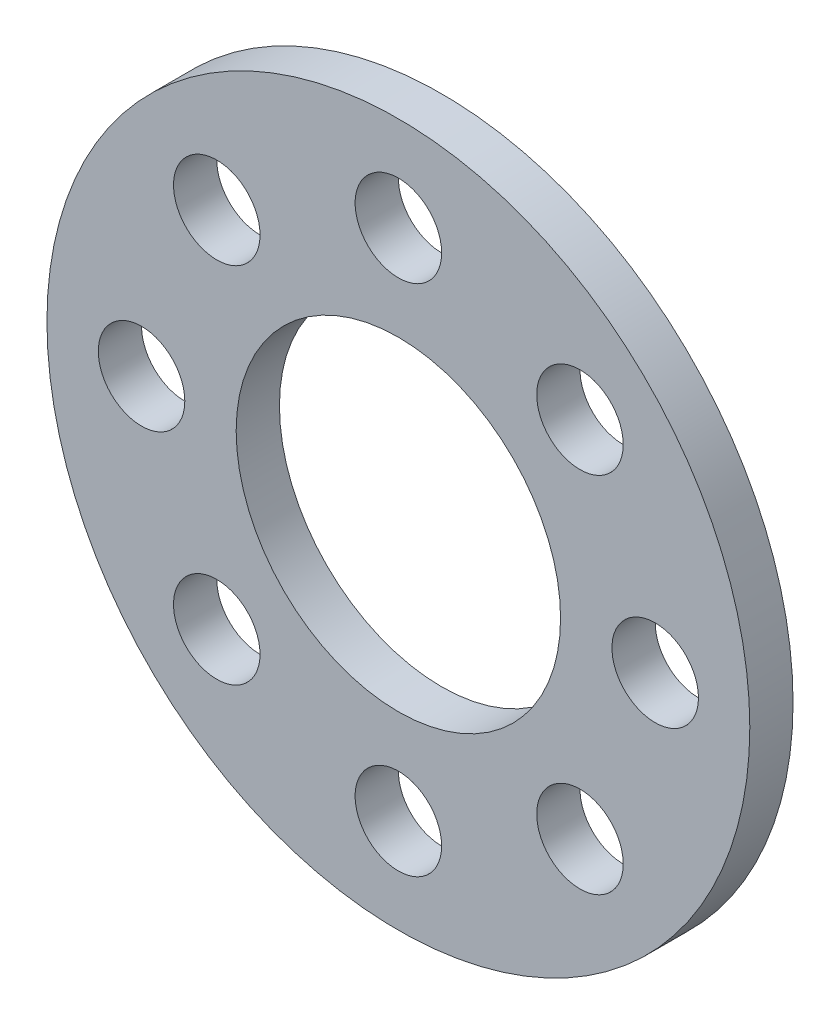
ISO-10303-21;
HEADER;
FILE_DESCRIPTION(('STEP AP214'),'2;1');
FILE_NAME('part.step','',(''),(''),'','','');
FILE_SCHEMA(('AUTOMOTIVE_DESIGN { 1 0 10303 214 1 1 1 1 }'));
ENDSEC;
DATA;
#1=APPLICATION_CONTEXT('core data for automotive mechanical design processes');
#2=APPLICATION_PROTOCOL_DEFINITION('international standard','automotive_design',2000,#1);
#3=PRODUCT_CONTEXT('',#1,'mechanical');
#4=PRODUCT('Part','Part','',(#3));
#5=PRODUCT_RELATED_PRODUCT_CATEGORY('part','',(#4));
#6=PRODUCT_DEFINITION_FORMATION('','',#4);
#7=PRODUCT_DEFINITION_CONTEXT('part definition',#1,'design');
#8=PRODUCT_DEFINITION('design','',#6,#7);
#9=PRODUCT_DEFINITION_SHAPE('','',#8);
#10=(LENGTH_UNIT() NAMED_UNIT(*) SI_UNIT(.MILLI.,.METRE.));
#11=(NAMED_UNIT(*) PLANE_ANGLE_UNIT() SI_UNIT($,.RADIAN.));
#12=(NAMED_UNIT(*) SI_UNIT($,.STERADIAN.) SOLID_ANGLE_UNIT());
#13=UNCERTAINTY_MEASURE_WITH_UNIT(LENGTH_MEASURE(1.E-05),#10,'distance_accuracy_value','');
#14=(GEOMETRIC_REPRESENTATION_CONTEXT(3) GLOBAL_UNCERTAINTY_ASSIGNED_CONTEXT((#13)) GLOBAL_UNIT_ASSIGNED_CONTEXT((#10,
#11,#12)) REPRESENTATION_CONTEXT('',''));
#15=CARTESIAN_POINT('',(0.,0.,0.));
#16=DIRECTION('',(0.,0.,1.));
#17=DIRECTION('',(1.,0.,0.));
#18=AXIS2_PLACEMENT_3D('',#15,#16,#17);
#19=CARTESIAN_POINT('',(0.,0.,2.));
#20=DIRECTION('',(0.,0.,1.));
#21=DIRECTION('',(1.,0.,0.));
#22=AXIS2_PLACEMENT_3D('',#19,#20,#21);
#23=PLANE('',#22);
#24=CARTESIAN_POINT('',(-11.874999999999,-1.01252339845814E-12,2.));
#25=DIRECTION('',(0.,0.,1.));
#26=DIRECTION('',(1.,0.,0.));
#27=AXIS2_PLACEMENT_3D('',#24,#25,#26);
#28=CIRCLE('',#27,2.00000000000138);
#29=CARTESIAN_POINT('',(-9.87499999999761,-1.01252339845814E-12,2.));
#30=VERTEX_POINT('',#29);
#31=EDGE_CURVE('E83',#30,#30,#28,.T.);
#32=ORIENTED_EDGE('',*,*,#31,.F.);
#33=EDGE_LOOP('',(#32));
#34=FACE_BOUND('',#33,.T.);
#35=CARTESIAN_POINT('',(2.02213826076831E-12,-11.875,2.));
#36=DIRECTION('',(0.,0.,1.));
#37=DIRECTION('',(1.,0.,0.));
#38=AXIS2_PLACEMENT_3D('',#35,#36,#37);
#39=CIRCLE('',#38,2.00000000000201);
#40=CARTESIAN_POINT('',(2.00000000000403,-11.875,2.));
#41=VERTEX_POINT('',#40);
#42=EDGE_CURVE('E71',#41,#41,#39,.T.);
#43=ORIENTED_EDGE('',*,*,#42,.F.);
#44=EDGE_LOOP('',(#43));
#45=FACE_BOUND('',#44,.T.);
#46=CARTESIAN_POINT('',(11.875000000001,1.01106913038416E-12,2.));
#47=DIRECTION('',(0.,0.,1.));
#48=DIRECTION('',(1.,0.,0.));
#49=AXIS2_PLACEMENT_3D('',#46,#47,#48);
#50=CIRCLE('',#49,2.00000000000071);
#51=CARTESIAN_POINT('',(13.8750000000017,1.01106913038416E-12,2.));
#52=VERTEX_POINT('',#51);
#53=EDGE_CURVE('E59',#52,#52,#50,.T.);
#54=ORIENTED_EDGE('',*,*,#53,.F.);
#55=EDGE_LOOP('',(#54));
#56=FACE_BOUND('',#55,.T.);
#57=CARTESIAN_POINT('',(0.,11.875,2.));
#58=DIRECTION('',(0.,0.,1.));
#59=DIRECTION('',(1.,0.,0.));
#60=AXIS2_PLACEMENT_3D('',#57,#58,#59);
#61=CIRCLE('',#60,2.);
#62=CARTESIAN_POINT('',(2.,11.875,2.));
#63=VERTEX_POINT('',#62);
#64=EDGE_CURVE('E47',#63,#63,#61,.T.);
#65=ORIENTED_EDGE('',*,*,#64,.F.);
#66=EDGE_LOOP('',(#65));
#67=FACE_BOUND('',#66,.T.);
#68=CARTESIAN_POINT('',(0.,0.,2.));
#69=DIRECTION('',(0.,0.,1.));
#70=DIRECTION('',(1.,0.,0.));
#71=AXIS2_PLACEMENT_3D('',#68,#69,#70);
#72=CIRCLE('',#71,16.25);
#73=CARTESIAN_POINT('',(16.25,0.,2.));
#74=VERTEX_POINT('',#73);
#75=EDGE_CURVE('E10',#74,#74,#72,.T.);
#76=ORIENTED_EDGE('',*,*,#75,.T.);
#77=EDGE_LOOP('',(#76));
#78=FACE_BOUND('',#77,.T.);
#79=CARTESIAN_POINT('',(0.,0.,2.));
#80=DIRECTION('',(0.,0.,1.));
#81=DIRECTION('',(1.,0.,0.));
#82=AXIS2_PLACEMENT_3D('',#79,#80,#81);
#83=CIRCLE('',#82,7.5);
#84=CARTESIAN_POINT('',(7.5,0.,2.));
#85=VERTEX_POINT('',#84);
#86=EDGE_CURVE('E42',#85,#85,#83,.T.);
#87=ORIENTED_EDGE('',*,*,#86,.F.);
#88=EDGE_LOOP('',(#87));
#89=FACE_BOUND('',#88,.T.);
#90=CARTESIAN_POINT('',(8.39689302659055,8.39689302659096,2.));
#91=DIRECTION('',(0.,0.,1.));
#92=DIRECTION('',(1.,0.,0.));
#93=AXIS2_PLACEMENT_3D('',#90,#91,#92);
#94=CIRCLE('',#93,2.00000000000009);
#95=CARTESIAN_POINT('',(10.3968930265906,8.39689302659096,2.));
#96=VERTEX_POINT('',#95);
#97=EDGE_CURVE('E53',#96,#96,#94,.T.);
#98=ORIENTED_EDGE('',*,*,#97,.F.);
#99=EDGE_LOOP('',(#98));
#100=FACE_BOUND('',#99,.T.);
#101=CARTESIAN_POINT('',(8.39689302659198,-8.39689302658954,2.));
#102=DIRECTION('',(0.,0.,1.));
#103=DIRECTION('',(1.,0.,0.));
#104=AXIS2_PLACEMENT_3D('',#101,#102,#103);
#105=CIRCLE('',#104,2.0000000000015);
#106=CARTESIAN_POINT('',(10.3968930265935,-8.39689302658954,2.));
#107=VERTEX_POINT('',#106);
#108=EDGE_CURVE('E65',#107,#107,#105,.T.);
#109=ORIENTED_EDGE('',*,*,#108,.F.);
#110=EDGE_LOOP('',(#109));
#111=FACE_BOUND('',#110,.T.);
#112=CARTESIAN_POINT('',(-8.39689302658853,-8.39689302659097,2.));
#113=DIRECTION('',(0.,0.,1.));
#114=DIRECTION('',(1.,0.,0.));
#115=AXIS2_PLACEMENT_3D('',#112,#113,#114);
#116=CIRCLE('',#115,2.00000000000196);
#117=CARTESIAN_POINT('',(-6.39689302658657,-8.39689302659097,2.));
#118=VERTEX_POINT('',#117);
#119=EDGE_CURVE('E77',#118,#118,#116,.T.);
#120=ORIENTED_EDGE('',*,*,#119,.F.);
#121=EDGE_LOOP('',(#120));
#122=FACE_BOUND('',#121,.T.);
#123=CARTESIAN_POINT('',(-8.39689302658996,8.39689302658953,2.));
#124=DIRECTION('',(0.,0.,1.));
#125=DIRECTION('',(1.,0.,0.));
#126=AXIS2_PLACEMENT_3D('',#123,#124,#125);
#127=CIRCLE('',#126,2.00000000000064);
#128=CARTESIAN_POINT('',(-6.39689302658932,8.39689302658953,2.));
#129=VERTEX_POINT('',#128);
#130=EDGE_CURVE('E89',#129,#129,#127,.T.);
#131=ORIENTED_EDGE('',*,*,#130,.F.);
#132=EDGE_LOOP('',(#131));
#133=FACE_BOUND('',#132,.T.);
#134=ADVANCED_FACE('F31',(#34,#45,#56,#67,#78,#89,#100,#111,#122,#133),#23,.T.);
#135=CARTESIAN_POINT('',(0.,0.,0.));
#136=DIRECTION('',(0.,0.,1.));
#137=DIRECTION('',(1.,0.,0.));
#138=AXIS2_PLACEMENT_3D('',#135,#136,#137);
#139=PLANE('',#138);
#140=CARTESIAN_POINT('',(0.,0.,0.));
#141=DIRECTION('',(0.,0.,1.));
#142=DIRECTION('',(1.,0.,0.));
#143=AXIS2_PLACEMENT_3D('',#140,#141,#142);
#144=CIRCLE('',#143,16.25);
#145=CARTESIAN_POINT('',(16.25,0.,0.));
#146=VERTEX_POINT('',#145);
#147=EDGE_CURVE('E35',#146,#146,#144,.T.);
#148=ORIENTED_EDGE('',*,*,#147,.F.);
#149=EDGE_LOOP('',(#148));
#150=FACE_BOUND('',#149,.T.);
#151=CARTESIAN_POINT('',(0.,0.,0.));
#152=DIRECTION('',(0.,0.,1.));
#153=DIRECTION('',(1.,0.,0.));
#154=AXIS2_PLACEMENT_3D('',#151,#152,#153);
#155=CIRCLE('',#154,7.5);
#156=CARTESIAN_POINT('',(7.5,0.,0.));
#157=VERTEX_POINT('',#156);
#158=EDGE_CURVE('E44',#157,#157,#155,.T.);
#159=ORIENTED_EDGE('',*,*,#158,.T.);
#160=EDGE_LOOP('',(#159));
#161=FACE_BOUND('',#160,.T.);
#162=CARTESIAN_POINT('',(0.,11.875,0.));
#163=DIRECTION('',(0.,0.,1.));
#164=DIRECTION('',(1.,0.,0.));
#165=AXIS2_PLACEMENT_3D('',#162,#163,#164);
#166=CIRCLE('',#165,2.);
#167=CARTESIAN_POINT('',(2.,11.875,0.));
#168=VERTEX_POINT('',#167);
#169=EDGE_CURVE('E50',#168,#168,#166,.T.);
#170=ORIENTED_EDGE('',*,*,#169,.T.);
#171=EDGE_LOOP('',(#170));
#172=FACE_BOUND('',#171,.T.);
#173=CARTESIAN_POINT('',(8.39689302659055,8.39689302659096,0.));
#174=DIRECTION('',(0.,0.,1.));
#175=DIRECTION('',(1.,0.,0.));
#176=AXIS2_PLACEMENT_3D('',#173,#174,#175);
#177=CIRCLE('',#176,2.00000000000009);
#178=CARTESIAN_POINT('',(10.3968930265906,8.39689302659096,0.));
#179=VERTEX_POINT('',#178);
#180=EDGE_CURVE('E56',#179,#179,#177,.T.);
#181=ORIENTED_EDGE('',*,*,#180,.T.);
#182=EDGE_LOOP('',(#181));
#183=FACE_BOUND('',#182,.T.);
#184=CARTESIAN_POINT('',(11.875000000001,1.01106913038416E-12,0.));
#185=DIRECTION('',(0.,0.,1.));
#186=DIRECTION('',(1.,0.,0.));
#187=AXIS2_PLACEMENT_3D('',#184,#185,#186);
#188=CIRCLE('',#187,2.00000000000071);
#189=CARTESIAN_POINT('',(13.8750000000017,1.01106913038416E-12,0.));
#190=VERTEX_POINT('',#189);
#191=EDGE_CURVE('E62',#190,#190,#188,.T.);
#192=ORIENTED_EDGE('',*,*,#191,.T.);
#193=EDGE_LOOP('',(#192));
#194=FACE_BOUND('',#193,.T.);
#195=CARTESIAN_POINT('',(8.39689302659198,-8.39689302658954,0.));
#196=DIRECTION('',(0.,0.,1.));
#197=DIRECTION('',(1.,0.,0.));
#198=AXIS2_PLACEMENT_3D('',#195,#196,#197);
#199=CIRCLE('',#198,2.0000000000015);
#200=CARTESIAN_POINT('',(10.3968930265935,-8.39689302658954,0.));
#201=VERTEX_POINT('',#200);
#202=EDGE_CURVE('E68',#201,#201,#199,.T.);
#203=ORIENTED_EDGE('',*,*,#202,.T.);
#204=EDGE_LOOP('',(#203));
#205=FACE_BOUND('',#204,.T.);
#206=CARTESIAN_POINT('',(2.02213826076831E-12,-11.875,0.));
#207=DIRECTION('',(0.,0.,1.));
#208=DIRECTION('',(1.,0.,0.));
#209=AXIS2_PLACEMENT_3D('',#206,#207,#208);
#210=CIRCLE('',#209,2.00000000000201);
#211=CARTESIAN_POINT('',(2.00000000000403,-11.875,0.));
#212=VERTEX_POINT('',#211);
#213=EDGE_CURVE('E74',#212,#212,#210,.T.);
#214=ORIENTED_EDGE('',*,*,#213,.T.);
#215=EDGE_LOOP('',(#214));
#216=FACE_BOUND('',#215,.T.);
#217=CARTESIAN_POINT('',(-8.39689302658853,-8.39689302659097,0.));
#218=DIRECTION('',(0.,0.,1.));
#219=DIRECTION('',(1.,0.,0.));
#220=AXIS2_PLACEMENT_3D('',#217,#218,#219);
#221=CIRCLE('',#220,2.00000000000196);
#222=CARTESIAN_POINT('',(-6.39689302658657,-8.39689302659097,0.));
#223=VERTEX_POINT('',#222);
#224=EDGE_CURVE('E80',#223,#223,#221,.T.);
#225=ORIENTED_EDGE('',*,*,#224,.T.);
#226=EDGE_LOOP('',(#225));
#227=FACE_BOUND('',#226,.T.);
#228=CARTESIAN_POINT('',(-11.874999999999,-1.01252339845814E-12,0.));
#229=DIRECTION('',(0.,0.,1.));
#230=DIRECTION('',(1.,0.,0.));
#231=AXIS2_PLACEMENT_3D('',#228,#229,#230);
#232=CIRCLE('',#231,2.00000000000138);
#233=CARTESIAN_POINT('',(-9.87499999999761,-1.01252339845814E-12,0.));
#234=VERTEX_POINT('',#233);
#235=EDGE_CURVE('E86',#234,#234,#232,.T.);
#236=ORIENTED_EDGE('',*,*,#235,.T.);
#237=EDGE_LOOP('',(#236));
#238=FACE_BOUND('',#237,.T.);
#239=CARTESIAN_POINT('',(-8.39689302658996,8.39689302658953,0.));
#240=DIRECTION('',(0.,0.,1.));
#241=DIRECTION('',(1.,0.,0.));
#242=AXIS2_PLACEMENT_3D('',#239,#240,#241);
#243=CIRCLE('',#242,2.00000000000064);
#244=CARTESIAN_POINT('',(-6.39689302658932,8.39689302658953,0.));
#245=VERTEX_POINT('',#244);
#246=EDGE_CURVE('E92',#245,#245,#243,.T.);
#247=ORIENTED_EDGE('',*,*,#246,.T.);
#248=EDGE_LOOP('',(#247));
#249=FACE_BOUND('',#248,.T.);
#250=ADVANCED_FACE('F102',(#150,#161,#172,#183,#194,#205,#216,#227,#238,#249),#139,.F.);
#251=CARTESIAN_POINT('',(0.,0.,2.));
#252=DIRECTION('',(0.,0.,-1.));
#253=DIRECTION('',(-1.,0.,0.));
#254=AXIS2_PLACEMENT_3D('',#251,#252,#253);
#255=CYLINDRICAL_SURFACE('',#254,16.25);
#256=ORIENTED_EDGE('',*,*,#75,.F.);
#257=EDGE_LOOP('',(#256));
#258=FACE_BOUND('',#257,.T.);
#259=ORIENTED_EDGE('',*,*,#147,.T.);
#260=EDGE_LOOP('',(#259));
#261=FACE_BOUND('',#260,.T.);
#262=ADVANCED_FACE('F33',(#258,#261),#255,.T.);
#263=CARTESIAN_POINT('',(0.,0.,2.));
#264=DIRECTION('',(0.,0.,-1.));
#265=DIRECTION('',(-1.,0.,0.));
#266=AXIS2_PLACEMENT_3D('',#263,#264,#265);
#267=CYLINDRICAL_SURFACE('',#266,7.5);
#268=ORIENTED_EDGE('',*,*,#86,.T.);
#269=EDGE_LOOP('',(#268));
#270=FACE_BOUND('',#269,.T.);
#271=ORIENTED_EDGE('',*,*,#158,.F.);
#272=EDGE_LOOP('',(#271));
#273=FACE_BOUND('',#272,.T.);
#274=ADVANCED_FACE('F112',(#270,#273),#267,.F.);
#275=CARTESIAN_POINT('',(0.,11.875,2.));
#276=DIRECTION('',(0.,0.,-1.));
#277=DIRECTION('',(-1.,0.,0.));
#278=AXIS2_PLACEMENT_3D('',#275,#276,#277);
#279=CYLINDRICAL_SURFACE('',#278,2.);
#280=ORIENTED_EDGE('',*,*,#64,.T.);
#281=EDGE_LOOP('',(#280));
#282=FACE_BOUND('',#281,.T.);
#283=ORIENTED_EDGE('',*,*,#169,.F.);
#284=EDGE_LOOP('',(#283));
#285=FACE_BOUND('',#284,.T.);
#286=ADVANCED_FACE('F115',(#282,#285),#279,.F.);
#287=CARTESIAN_POINT('',(8.39689302659055,8.39689302659096,2.));
#288=DIRECTION('',(0.,0.,-1.));
#289=DIRECTION('',(-1.,0.,0.));
#290=AXIS2_PLACEMENT_3D('',#287,#288,#289);
#291=CYLINDRICAL_SURFACE('',#290,2.00000000000009);
#292=ORIENTED_EDGE('',*,*,#97,.T.);
#293=EDGE_LOOP('',(#292));
#294=FACE_BOUND('',#293,.T.);
#295=ORIENTED_EDGE('',*,*,#180,.F.);
#296=EDGE_LOOP('',(#295));
#297=FACE_BOUND('',#296,.T.);
#298=ADVANCED_FACE('F119',(#294,#297),#291,.F.);
#299=CARTESIAN_POINT('',(11.875000000001,1.01106913038416E-12,2.));
#300=DIRECTION('',(0.,0.,-1.));
#301=DIRECTION('',(-1.,0.,0.));
#302=AXIS2_PLACEMENT_3D('',#299,#300,#301);
#303=CYLINDRICAL_SURFACE('',#302,2.00000000000071);
#304=ORIENTED_EDGE('',*,*,#53,.T.);
#305=EDGE_LOOP('',(#304));
#306=FACE_BOUND('',#305,.T.);
#307=ORIENTED_EDGE('',*,*,#191,.F.);
#308=EDGE_LOOP('',(#307));
#309=FACE_BOUND('',#308,.T.);
#310=ADVANCED_FACE('F123',(#306,#309),#303,.F.);
#311=CARTESIAN_POINT('',(8.39689302659198,-8.39689302658954,2.));
#312=DIRECTION('',(0.,0.,-1.));
#313=DIRECTION('',(-1.,0.,0.));
#314=AXIS2_PLACEMENT_3D('',#311,#312,#313);
#315=CYLINDRICAL_SURFACE('',#314,2.0000000000015);
#316=ORIENTED_EDGE('',*,*,#108,.T.);
#317=EDGE_LOOP('',(#316));
#318=FACE_BOUND('',#317,.T.);
#319=ORIENTED_EDGE('',*,*,#202,.F.);
#320=EDGE_LOOP('',(#319));
#321=FACE_BOUND('',#320,.T.);
#322=ADVANCED_FACE('F127',(#318,#321),#315,.F.);
#323=CARTESIAN_POINT('',(2.02213826076831E-12,-11.875,2.));
#324=DIRECTION('',(0.,0.,-1.));
#325=DIRECTION('',(-1.,0.,0.));
#326=AXIS2_PLACEMENT_3D('',#323,#324,#325);
#327=CYLINDRICAL_SURFACE('',#326,2.00000000000201);
#328=ORIENTED_EDGE('',*,*,#42,.T.);
#329=EDGE_LOOP('',(#328));
#330=FACE_BOUND('',#329,.T.);
#331=ORIENTED_EDGE('',*,*,#213,.F.);
#332=EDGE_LOOP('',(#331));
#333=FACE_BOUND('',#332,.T.);
#334=ADVANCED_FACE('F131',(#330,#333),#327,.F.);
#335=CARTESIAN_POINT('',(-8.39689302658853,-8.39689302659097,2.));
#336=DIRECTION('',(0.,0.,-1.));
#337=DIRECTION('',(-1.,0.,0.));
#338=AXIS2_PLACEMENT_3D('',#335,#336,#337);
#339=CYLINDRICAL_SURFACE('',#338,2.00000000000196);
#340=ORIENTED_EDGE('',*,*,#119,.T.);
#341=EDGE_LOOP('',(#340));
#342=FACE_BOUND('',#341,.T.);
#343=ORIENTED_EDGE('',*,*,#224,.F.);
#344=EDGE_LOOP('',(#343));
#345=FACE_BOUND('',#344,.T.);
#346=ADVANCED_FACE('F135',(#342,#345),#339,.F.);
#347=CARTESIAN_POINT('',(-11.874999999999,-1.01252339845814E-12,2.));
#348=DIRECTION('',(0.,0.,-1.));
#349=DIRECTION('',(-1.,0.,0.));
#350=AXIS2_PLACEMENT_3D('',#347,#348,#349);
#351=CYLINDRICAL_SURFACE('',#350,2.00000000000138);
#352=ORIENTED_EDGE('',*,*,#31,.T.);
#353=EDGE_LOOP('',(#352));
#354=FACE_BOUND('',#353,.T.);
#355=ORIENTED_EDGE('',*,*,#235,.F.);
#356=EDGE_LOOP('',(#355));
#357=FACE_BOUND('',#356,.T.);
#358=ADVANCED_FACE('F139',(#354,#357),#351,.F.);
#359=CARTESIAN_POINT('',(-8.39689302658996,8.39689302658953,2.));
#360=DIRECTION('',(0.,0.,-1.));
#361=DIRECTION('',(-1.,0.,0.));
#362=AXIS2_PLACEMENT_3D('',#359,#360,#361);
#363=CYLINDRICAL_SURFACE('',#362,2.00000000000064);
#364=ORIENTED_EDGE('',*,*,#130,.T.);
#365=EDGE_LOOP('',(#364));
#366=FACE_BOUND('',#365,.T.);
#367=ORIENTED_EDGE('',*,*,#246,.F.);
#368=EDGE_LOOP('',(#367));
#369=FACE_BOUND('',#368,.T.);
#370=ADVANCED_FACE('F98',(#366,#369),#363,.F.);
#371=CLOSED_SHELL('',(#134,#250,#262,#274,#286,#298,#310,#322,#334,#346,#358,#370));
#372=MANIFOLD_SOLID_BREP('B2',#371);
#373=ADVANCED_BREP_SHAPE_REPRESENTATION('',(#18,#372),#14);
#374=SHAPE_DEFINITION_REPRESENTATION(#9,#373);
ENDSEC;
END-ISO-10303-21;
